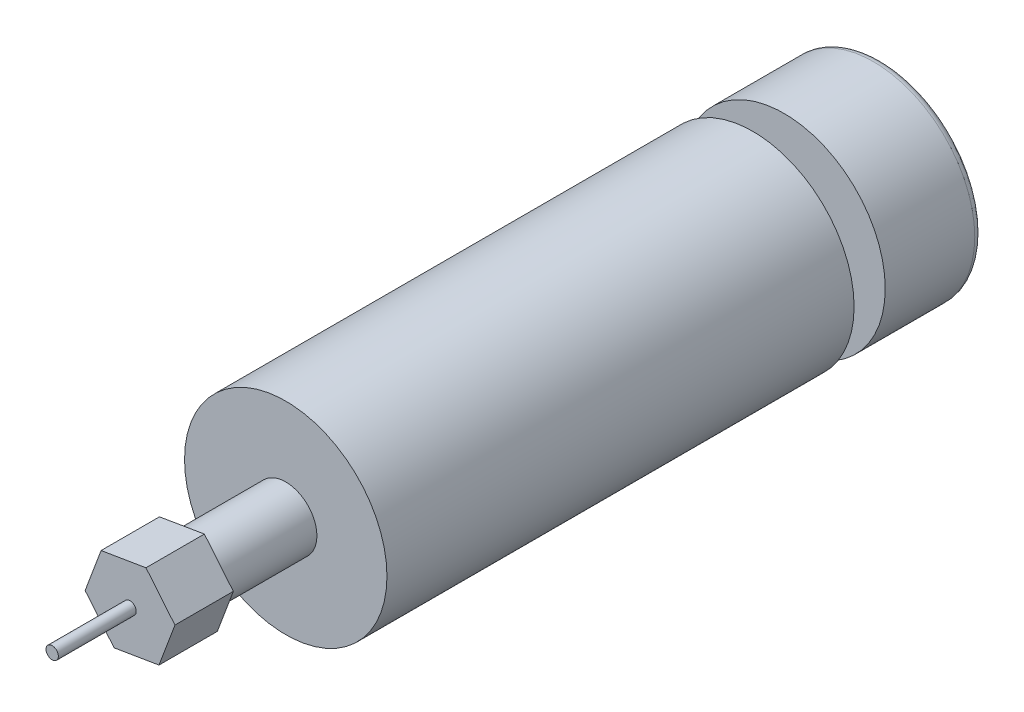
ISO-10303-21;
HEADER;
FILE_DESCRIPTION(('STEP AP214'),'2;1');
FILE_NAME('part.step','',(''),(''),'','','');
FILE_SCHEMA(('AUTOMOTIVE_DESIGN { 1 0 10303 214 1 1 1 1 }'));
ENDSEC;
DATA;
#1=APPLICATION_CONTEXT('core data for automotive mechanical design processes');
#2=APPLICATION_PROTOCOL_DEFINITION('international standard','automotive_design',2000,#1);
#3=PRODUCT_CONTEXT('',#1,'mechanical');
#4=PRODUCT('Part','Part','',(#3));
#5=PRODUCT_RELATED_PRODUCT_CATEGORY('part','',(#4));
#6=PRODUCT_DEFINITION_FORMATION('','',#4);
#7=PRODUCT_DEFINITION_CONTEXT('part definition',#1,'design');
#8=PRODUCT_DEFINITION('design','',#6,#7);
#9=PRODUCT_DEFINITION_SHAPE('','',#8);
#10=(LENGTH_UNIT() NAMED_UNIT(*) SI_UNIT(.MILLI.,.METRE.));
#11=(NAMED_UNIT(*) PLANE_ANGLE_UNIT() SI_UNIT($,.RADIAN.));
#12=(NAMED_UNIT(*) SI_UNIT($,.STERADIAN.) SOLID_ANGLE_UNIT());
#13=UNCERTAINTY_MEASURE_WITH_UNIT(LENGTH_MEASURE(1.E-05),#10,'distance_accuracy_value','');
#14=(GEOMETRIC_REPRESENTATION_CONTEXT(3) GLOBAL_UNCERTAINTY_ASSIGNED_CONTEXT((#13)) GLOBAL_UNIT_ASSIGNED_CONTEXT((#10,
#11,#12)) REPRESENTATION_CONTEXT('',''));
#15=CARTESIAN_POINT('',(0.,0.,0.));
#16=DIRECTION('',(0.,0.,1.));
#17=DIRECTION('',(1.,0.,0.));
#18=AXIS2_PLACEMENT_3D('',#15,#16,#17);
#19=CARTESIAN_POINT('',(0.,0.,-33.));
#20=DIRECTION('',(0.,0.,1.));
#21=DIRECTION('',(1.,0.,0.));
#22=AXIS2_PLACEMENT_3D('',#19,#20,#21);
#23=CYLINDRICAL_SURFACE('',#22,26.);
#24=CARTESIAN_POINT('',(0.,0.,-31.));
#25=DIRECTION('',(0.,0.,-1.));
#26=DIRECTION('',(-1.,0.,0.));
#27=AXIS2_PLACEMENT_3D('',#24,#25,#26);
#28=CIRCLE('',#27,26.);
#29=CARTESIAN_POINT('',(-26.,0.,-31.));
#30=VERTEX_POINT('',#29);
#31=EDGE_CURVE('E11',#30,#30,#28,.F.);
#32=ORIENTED_EDGE('',*,*,#31,.T.);
#33=EDGE_LOOP('',(#32));
#34=FACE_BOUND('',#33,.T.);
#35=CARTESIAN_POINT('',(0.,0.,-8.));
#36=DIRECTION('',(0.,0.,-1.));
#37=DIRECTION('',(-1.,0.,0.));
#38=AXIS2_PLACEMENT_3D('',#35,#36,#37);
#39=CIRCLE('',#38,26.);
#40=CARTESIAN_POINT('',(-26.,0.,-8.));
#41=VERTEX_POINT('',#40);
#42=EDGE_CURVE('E51',#41,#41,#39,.T.);
#43=ORIENTED_EDGE('',*,*,#42,.T.);
#44=EDGE_LOOP('',(#43));
#45=FACE_BOUND('',#44,.T.);
#46=ADVANCED_FACE('F40',(#34,#45),#23,.T.);
#47=CARTESIAN_POINT('',(0.,0.,-33.));
#48=DIRECTION('',(0.,0.,-1.));
#49=DIRECTION('',(-1.,0.,0.));
#50=AXIS2_PLACEMENT_3D('',#47,#48,#49);
#51=PLANE('',#50);
#52=CARTESIAN_POINT('',(0.,0.,-33.));
#53=DIRECTION('',(0.,0.,-1.));
#54=DIRECTION('',(-1.,0.,0.));
#55=AXIS2_PLACEMENT_3D('',#52,#53,#54);
#56=CIRCLE('',#55,24.);
#57=CARTESIAN_POINT('',(-24.,0.,-33.));
#58=VERTEX_POINT('',#57);
#59=EDGE_CURVE('E47',#58,#58,#56,.T.);
#60=ORIENTED_EDGE('',*,*,#59,.T.);
#61=EDGE_LOOP('',(#60));
#62=FACE_BOUND('',#61,.T.);
#63=ADVANCED_FACE('F61',(#62),#51,.T.);
#64=CARTESIAN_POINT('',(0.,0.,-8.));
#65=DIRECTION('',(0.,0.,-1.));
#66=DIRECTION('',(-1.,0.,0.));
#67=AXIS2_PLACEMENT_3D('',#64,#65,#66);
#68=PLANE('',#67);
#69=ORIENTED_EDGE('',*,*,#42,.F.);
#70=EDGE_LOOP('',(#69));
#71=FACE_BOUND('',#70,.T.);
#72=ADVANCED_FACE('F59',(#71),#68,.F.);
#73=CARTESIAN_POINT('',(0.,0.,-31.));
#74=DIRECTION('',(0.,0.,-1.));
#75=DIRECTION('',(-1.,0.,0.));
#76=AXIS2_PLACEMENT_3D('',#73,#74,#75);
#77=TOROIDAL_SURFACE('',#76,24.,2.);
#78=ORIENTED_EDGE('',*,*,#31,.F.);
#79=EDGE_LOOP('',(#78));
#80=FACE_BOUND('',#79,.T.);
#81=ORIENTED_EDGE('',*,*,#59,.F.);
#82=EDGE_LOOP('',(#81));
#83=FACE_BOUND('',#82,.T.);
#84=ADVANCED_FACE('F42',(#80,#83),#77,.T.);
#85=CLOSED_SHELL('',(#46,#63,#72,#84));
#86=MANIFOLD_SOLID_BREP('B2',#85);
#87=CARTESIAN_POINT('',(0.,0.,160.));
#88=DIRECTION('',(0.,0.,-1.));
#89=DIRECTION('',(-1.,0.,0.));
#90=AXIS2_PLACEMENT_3D('',#87,#88,#89);
#91=CYLINDRICAL_SURFACE('',#90,8.);
#92=CARTESIAN_POINT('',(0.,0.,120.));
#93=DIRECTION('',(0.,0.,1.));
#94=DIRECTION('',(1.,0.,0.));
#95=AXIS2_PLACEMENT_3D('',#92,#93,#94);
#96=CIRCLE('',#95,8.);
#97=CARTESIAN_POINT('',(8.,0.,120.));
#98=VERTEX_POINT('',#97);
#99=EDGE_CURVE('E204',#98,#98,#96,.T.);
#100=ORIENTED_EDGE('',*,*,#99,.T.);
#101=EDGE_LOOP('',(#100));
#102=FACE_BOUND('',#101,.T.);
#103=CARTESIAN_POINT('',(0.,0.,145.));
#104=DIRECTION('',(0.,0.,1.));
#105=DIRECTION('',(1.,0.,0.));
#106=AXIS2_PLACEMENT_3D('',#103,#104,#105);
#107=CIRCLE('',#106,8.);
#108=CARTESIAN_POINT('',(8.,0.,145.));
#109=VERTEX_POINT('',#108);
#110=EDGE_CURVE('E216',#109,#109,#107,.T.);
#111=ORIENTED_EDGE('',*,*,#110,.F.);
#112=EDGE_LOOP('',(#111));
#113=FACE_BOUND('',#112,.T.);
#114=ADVANCED_FACE('F96',(#102,#113),#91,.T.);
#115=CARTESIAN_POINT('',(0.,0.,120.));
#116=DIRECTION('',(0.,0.,1.));
#117=DIRECTION('',(1.,0.,0.));
#118=AXIS2_PLACEMENT_3D('',#115,#116,#117);
#119=PLANE('',#118);
#120=CARTESIAN_POINT('',(0.,0.,120.));
#121=DIRECTION('',(0.,0.,1.));
#122=DIRECTION('',(1.,0.,0.));
#123=AXIS2_PLACEMENT_3D('',#120,#121,#122);
#124=CIRCLE('',#123,26.);
#125=CARTESIAN_POINT('',(26.,0.,120.));
#126=VERTEX_POINT('',#125);
#127=EDGE_CURVE('E213',#126,#126,#124,.T.);
#128=ORIENTED_EDGE('',*,*,#127,.T.);
#129=EDGE_LOOP('',(#128));
#130=FACE_BOUND('',#129,.T.);
#131=ORIENTED_EDGE('',*,*,#99,.F.);
#132=EDGE_LOOP('',(#131));
#133=FACE_BOUND('',#132,.T.);
#134=ADVANCED_FACE('F245',(#130,#133),#119,.T.);
#135=CARTESIAN_POINT('',(0.,0.,120.));
#136=DIRECTION('',(0.,0.,-1.));
#137=DIRECTION('',(-1.,0.,0.));
#138=AXIS2_PLACEMENT_3D('',#135,#136,#137);
#139=CYLINDRICAL_SURFACE('',#138,26.);
#140=ORIENTED_EDGE('',*,*,#127,.F.);
#141=EDGE_LOOP('',(#140));
#142=FACE_BOUND('',#141,.T.);
#143=CARTESIAN_POINT('',(0.,0.,0.));
#144=DIRECTION('',(0.,0.,1.));
#145=DIRECTION('',(1.,0.,0.));
#146=AXIS2_PLACEMENT_3D('',#143,#144,#145);
#147=CIRCLE('',#146,26.);
#148=CARTESIAN_POINT('',(26.,0.,0.));
#149=VERTEX_POINT('',#148);
#150=EDGE_CURVE('E212',#149,#149,#147,.T.);
#151=ORIENTED_EDGE('',*,*,#150,.T.);
#152=EDGE_LOOP('',(#151));
#153=FACE_BOUND('',#152,.T.);
#154=ADVANCED_FACE('F98',(#142,#153),#139,.T.);
#155=CARTESIAN_POINT('',(0.,0.,0.));
#156=DIRECTION('',(0.,0.,1.));
#157=DIRECTION('',(1.,0.,0.));
#158=AXIS2_PLACEMENT_3D('',#155,#156,#157);
#159=PLANE('',#158);
#160=CARTESIAN_POINT('',(0.,0.,0.));
#161=DIRECTION('',(0.,0.,-1.));
#162=DIRECTION('',(-1.,0.,0.));
#163=AXIS2_PLACEMENT_3D('',#160,#161,#162);
#164=CIRCLE('',#163,4.);
#165=CARTESIAN_POINT('',(-4.,0.,0.));
#166=VERTEX_POINT('',#165);
#167=EDGE_CURVE('E38',#166,#166,#164,.T.);
#168=ORIENTED_EDGE('',*,*,#167,.F.);
#169=EDGE_LOOP('',(#168));
#170=FACE_BOUND('',#169,.T.);
#171=ORIENTED_EDGE('',*,*,#150,.F.);
#172=EDGE_LOOP('',(#171));
#173=FACE_BOUND('',#172,.T.);
#174=ADVANCED_FACE('F256',(#170,#173),#159,.F.);
#175=CARTESIAN_POINT('',(0.,0.,145.));
#176=DIRECTION('',(0.,0.,1.));
#177=DIRECTION('',(1.,0.,0.));
#178=AXIS2_PLACEMENT_3D('',#175,#176,#177);
#179=PLANE('',#178);
#180=DIRECTION('',(0.350207381259462,0.9366721892484,0.));
#181=VECTOR('',#180,1.);
#182=CARTESIAN_POINT('',(7.43863571553627,-9.02378670105563,145.));
#183=LINE('',#182,#181);
#184=CARTESIAN_POINT('',(7.43863571553627,-9.02378670105563,145.));
#185=VERTEX_POINT('',#184);
#186=CARTESIAN_POINT('',(11.5341463792145,1.93015414862484,145.));
#187=VERTEX_POINT('',#186);
#188=EDGE_CURVE('E202',#185,#187,#183,.T.);
#189=ORIENTED_EDGE('',*,*,#188,.F.);
#190=DIRECTION('',(0.98628560153723,0.165047605860684,0.));
#191=VECTOR('',#190,1.);
#192=CARTESIAN_POINT('',(-4.09551066367821,-10.9539408496805,145.));
#193=LINE('',#192,#191);
#194=CARTESIAN_POINT('',(-4.09551066367821,-10.9539408496805,145.));
#195=VERTEX_POINT('',#194);
#196=EDGE_CURVE('E176',#195,#185,#193,.T.);
#197=ORIENTED_EDGE('',*,*,#196,.F.);
#198=DIRECTION('',(0.636078220277769,-0.771624583387716,0.));
#199=VECTOR('',#198,1.);
#200=CARTESIAN_POINT('',(-11.5341463792145,-1.93015414862484,145.));
#201=LINE('',#200,#199);
#202=CARTESIAN_POINT('',(-11.5341463792145,-1.93015414862484,145.));
#203=VERTEX_POINT('',#202);
#204=EDGE_CURVE('E160',#203,#195,#201,.T.);
#205=ORIENTED_EDGE('',*,*,#204,.F.);
#206=DIRECTION('',(-0.350207381259462,-0.9366721892484,0.));
#207=VECTOR('',#206,1.);
#208=CARTESIAN_POINT('',(-7.43863571553628,9.02378670105563,145.));
#209=LINE('',#208,#207);
#210=CARTESIAN_POINT('',(-7.43863571553628,9.02378670105563,145.));
#211=VERTEX_POINT('',#210);
#212=EDGE_CURVE('E174',#211,#203,#209,.T.);
#213=ORIENTED_EDGE('',*,*,#212,.F.);
#214=DIRECTION('',(-0.98628560153723,-0.165047605860684,0.));
#215=VECTOR('',#214,1.);
#216=CARTESIAN_POINT('',(4.09551066367821,10.9539408496805,145.));
#217=LINE('',#216,#215);
#218=CARTESIAN_POINT('',(4.09551066367821,10.9539408496805,145.));
#219=VERTEX_POINT('',#218);
#220=EDGE_CURVE('E179',#219,#211,#217,.T.);
#221=ORIENTED_EDGE('',*,*,#220,.F.);
#222=DIRECTION('',(-0.636078220277769,0.771624583387716,0.));
#223=VECTOR('',#222,1.);
#224=CARTESIAN_POINT('',(11.5341463792145,1.93015414862484,145.));
#225=LINE('',#224,#223);
#226=EDGE_CURVE('E181',#187,#219,#225,.T.);
#227=ORIENTED_EDGE('',*,*,#226,.F.);
#228=EDGE_LOOP('',(#189,#197,#205,#213,#221,#227));
#229=FACE_BOUND('',#228,.T.);
#230=ORIENTED_EDGE('',*,*,#110,.T.);
#231=EDGE_LOOP('',(#230));
#232=FACE_BOUND('',#231,.T.);
#233=ADVANCED_FACE('F171',(#229,#232),#179,.F.);
#234=CARTESIAN_POINT('',(7.43863571553627,-9.02378670105563,145.));
#235=DIRECTION('',(0.9366721892484,-0.350207381259462,0.));
#236=DIRECTION('',(0.350207381259462,0.9366721892484,0.));
#237=AXIS2_PLACEMENT_3D('',#234,#235,#236);
#238=PLANE('',#237);
#239=DIRECTION('',(0.350207381259462,0.9366721892484,0.));
#240=VECTOR('',#239,1.);
#241=CARTESIAN_POINT('',(7.43863571553627,-9.02378670105563,160.));
#242=LINE('',#241,#240);
#243=CARTESIAN_POINT('',(7.43863571553627,-9.02378670105563,160.));
#244=VERTEX_POINT('',#243);
#245=CARTESIAN_POINT('',(11.5341463792145,1.93015414862484,160.));
#246=VERTEX_POINT('',#245);
#247=EDGE_CURVE('E186',#244,#246,#242,.T.);
#248=ORIENTED_EDGE('',*,*,#247,.F.);
#249=DIRECTION('',(0.,0.,1.));
#250=VECTOR('',#249,1.);
#251=CARTESIAN_POINT('',(7.43863571553627,-9.02378670105563,145.));
#252=LINE('',#251,#250);
#253=EDGE_CURVE('E114',#185,#244,#252,.T.);
#254=ORIENTED_EDGE('',*,*,#253,.F.);
#255=ORIENTED_EDGE('',*,*,#188,.T.);
#256=DIRECTION('',(0.,0.,1.));
#257=VECTOR('',#256,1.);
#258=CARTESIAN_POINT('',(11.5341463792145,1.93015414862484,145.));
#259=LINE('',#258,#257);
#260=EDGE_CURVE('E149',#187,#246,#259,.T.);
#261=ORIENTED_EDGE('',*,*,#260,.T.);
#262=EDGE_LOOP('',(#248,#254,#255,#261));
#263=FACE_BOUND('',#262,.T.);
#264=ADVANCED_FACE('F230',(#263),#238,.T.);
#265=CARTESIAN_POINT('',(-4.09551066367821,-10.9539408496805,145.));
#266=DIRECTION('',(0.165047605860684,-0.98628560153723,0.));
#267=DIRECTION('',(0.98628560153723,0.165047605860684,0.));
#268=AXIS2_PLACEMENT_3D('',#265,#266,#267);
#269=PLANE('',#268);
#270=DIRECTION('',(0.98628560153723,0.165047605860684,0.));
#271=VECTOR('',#270,1.);
#272=CARTESIAN_POINT('',(-4.09551066367821,-10.9539408496805,160.));
#273=LINE('',#272,#271);
#274=CARTESIAN_POINT('',(-4.09551066367821,-10.9539408496805,160.));
#275=VERTEX_POINT('',#274);
#276=EDGE_CURVE('E199',#275,#244,#273,.T.);
#277=ORIENTED_EDGE('',*,*,#276,.F.);
#278=DIRECTION('',(0.,0.,1.));
#279=VECTOR('',#278,1.);
#280=CARTESIAN_POINT('',(-4.09551066367821,-10.9539408496805,145.));
#281=LINE('',#280,#279);
#282=EDGE_CURVE('E137',#195,#275,#281,.T.);
#283=ORIENTED_EDGE('',*,*,#282,.F.);
#284=ORIENTED_EDGE('',*,*,#196,.T.);
#285=ORIENTED_EDGE('',*,*,#253,.T.);
#286=EDGE_LOOP('',(#277,#283,#284,#285));
#287=FACE_BOUND('',#286,.T.);
#288=ADVANCED_FACE('F234',(#287),#269,.T.);
#289=CARTESIAN_POINT('',(-11.5341463792145,-1.93015414862484,145.));
#290=DIRECTION('',(-0.771624583387716,-0.636078220277769,0.));
#291=DIRECTION('',(0.636078220277769,-0.771624583387716,0.));
#292=AXIS2_PLACEMENT_3D('',#289,#290,#291);
#293=PLANE('',#292);
#294=DIRECTION('',(0.636078220277769,-0.771624583387716,0.));
#295=VECTOR('',#294,1.);
#296=CARTESIAN_POINT('',(-11.5341463792145,-1.93015414862484,160.));
#297=LINE('',#296,#295);
#298=CARTESIAN_POINT('',(-11.5341463792145,-1.93015414862484,160.));
#299=VERTEX_POINT('',#298);
#300=EDGE_CURVE('E162',#299,#275,#297,.T.);
#301=ORIENTED_EDGE('',*,*,#300,.F.);
#302=DIRECTION('',(0.,0.,1.));
#303=VECTOR('',#302,1.);
#304=CARTESIAN_POINT('',(-11.5341463792145,-1.93015414862484,145.));
#305=LINE('',#304,#303);
#306=EDGE_CURVE('E157',#203,#299,#305,.T.);
#307=ORIENTED_EDGE('',*,*,#306,.F.);
#308=ORIENTED_EDGE('',*,*,#204,.T.);
#309=ORIENTED_EDGE('',*,*,#282,.T.);
#310=EDGE_LOOP('',(#301,#307,#308,#309));
#311=FACE_BOUND('',#310,.T.);
#312=ADVANCED_FACE('F159',(#311),#293,.T.);
#313=CARTESIAN_POINT('',(-7.43863571553628,9.02378670105563,145.));
#314=DIRECTION('',(-0.9366721892484,0.350207381259462,0.));
#315=DIRECTION('',(-0.350207381259462,-0.9366721892484,0.));
#316=AXIS2_PLACEMENT_3D('',#313,#314,#315);
#317=PLANE('',#316);
#318=DIRECTION('',(-0.350207381259462,-0.9366721892484,0.));
#319=VECTOR('',#318,1.);
#320=CARTESIAN_POINT('',(-7.43863571553628,9.02378670105563,160.));
#321=LINE('',#320,#319);
#322=CARTESIAN_POINT('',(-7.43863571553628,9.02378670105563,160.));
#323=VERTEX_POINT('',#322);
#324=EDGE_CURVE('E196',#323,#299,#321,.T.);
#325=ORIENTED_EDGE('',*,*,#324,.F.);
#326=DIRECTION('',(0.,0.,1.));
#327=VECTOR('',#326,1.);
#328=CARTESIAN_POINT('',(-7.43863571553628,9.02378670105563,145.));
#329=LINE('',#328,#327);
#330=EDGE_CURVE('E167',#211,#323,#329,.T.);
#331=ORIENTED_EDGE('',*,*,#330,.F.);
#332=ORIENTED_EDGE('',*,*,#212,.T.);
#333=ORIENTED_EDGE('',*,*,#306,.T.);
#334=EDGE_LOOP('',(#325,#331,#332,#333));
#335=FACE_BOUND('',#334,.T.);
#336=ADVANCED_FACE('F178',(#335),#317,.T.);
#337=CARTESIAN_POINT('',(4.09551066367821,10.9539408496805,145.));
#338=DIRECTION('',(-0.165047605860684,0.98628560153723,0.));
#339=DIRECTION('',(-0.98628560153723,-0.165047605860684,0.));
#340=AXIS2_PLACEMENT_3D('',#337,#338,#339);
#341=PLANE('',#340);
#342=DIRECTION('',(-0.98628560153723,-0.165047605860684,0.));
#343=VECTOR('',#342,1.);
#344=CARTESIAN_POINT('',(4.09551066367821,10.9539408496805,160.));
#345=LINE('',#344,#343);
#346=CARTESIAN_POINT('',(4.09551066367821,10.9539408496805,160.));
#347=VERTEX_POINT('',#346);
#348=EDGE_CURVE('E193',#347,#323,#345,.T.);
#349=ORIENTED_EDGE('',*,*,#348,.F.);
#350=DIRECTION('',(0.,0.,1.));
#351=VECTOR('',#350,1.);
#352=CARTESIAN_POINT('',(4.09551066367821,10.9539408496805,145.));
#353=LINE('',#352,#351);
#354=EDGE_CURVE('E207',#219,#347,#353,.T.);
#355=ORIENTED_EDGE('',*,*,#354,.F.);
#356=ORIENTED_EDGE('',*,*,#220,.T.);
#357=ORIENTED_EDGE('',*,*,#330,.T.);
#358=EDGE_LOOP('',(#349,#355,#356,#357));
#359=FACE_BOUND('',#358,.T.);
#360=ADVANCED_FACE('F233',(#359),#341,.T.);
#361=CARTESIAN_POINT('',(11.5341463792145,1.93015414862484,145.));
#362=DIRECTION('',(0.771624583387716,0.636078220277769,0.));
#363=DIRECTION('',(-0.636078220277769,0.771624583387716,0.));
#364=AXIS2_PLACEMENT_3D('',#361,#362,#363);
#365=PLANE('',#364);
#366=DIRECTION('',(-0.636078220277769,0.771624583387716,0.));
#367=VECTOR('',#366,1.);
#368=CARTESIAN_POINT('',(11.5341463792145,1.93015414862484,160.));
#369=LINE('',#368,#367);
#370=EDGE_CURVE('E189',#246,#347,#369,.T.);
#371=ORIENTED_EDGE('',*,*,#370,.F.);
#372=ORIENTED_EDGE('',*,*,#260,.F.);
#373=ORIENTED_EDGE('',*,*,#226,.T.);
#374=ORIENTED_EDGE('',*,*,#354,.T.);
#375=EDGE_LOOP('',(#371,#372,#373,#374));
#376=FACE_BOUND('',#375,.T.);
#377=ADVANCED_FACE('F228',(#376),#365,.T.);
#378=CARTESIAN_POINT('',(0.,0.,160.));
#379=DIRECTION('',(0.,0.,1.));
#380=DIRECTION('',(1.,0.,0.));
#381=AXIS2_PLACEMENT_3D('',#378,#379,#380);
#382=PLANE('',#381);
#383=CARTESIAN_POINT('',(0.,0.,160.));
#384=DIRECTION('',(0.,0.,1.));
#385=DIRECTION('',(1.,0.,0.));
#386=AXIS2_PLACEMENT_3D('',#383,#384,#385);
#387=CIRCLE('',#386,1.5875);
#388=CARTESIAN_POINT('',(1.5875,0.,160.));
#389=VERTEX_POINT('',#388);
#390=EDGE_CURVE('E100',#389,#389,#387,.T.);
#391=ORIENTED_EDGE('',*,*,#390,.F.);
#392=EDGE_LOOP('',(#391));
#393=FACE_BOUND('',#392,.T.);
#394=ORIENTED_EDGE('',*,*,#247,.T.);
#395=ORIENTED_EDGE('',*,*,#370,.T.);
#396=ORIENTED_EDGE('',*,*,#348,.T.);
#397=ORIENTED_EDGE('',*,*,#324,.T.);
#398=ORIENTED_EDGE('',*,*,#300,.T.);
#399=ORIENTED_EDGE('',*,*,#276,.T.);
#400=EDGE_LOOP('',(#394,#395,#396,#397,#398,#399));
#401=FACE_BOUND('',#400,.T.);
#402=ADVANCED_FACE('F225',(#393,#401),#382,.T.);
#403=CARTESIAN_POINT('',(0.,0.,180.));
#404=DIRECTION('',(0.,0.,-1.));
#405=DIRECTION('',(-1.,0.,0.));
#406=AXIS2_PLACEMENT_3D('',#403,#404,#405);
#407=CYLINDRICAL_SURFACE('',#406,1.5875);
#408=CARTESIAN_POINT('',(0.,0.,180.));
#409=DIRECTION('',(0.,0.,-1.));
#410=DIRECTION('',(-1.,0.,0.));
#411=AXIS2_PLACEMENT_3D('',#408,#409,#410);
#412=CIRCLE('',#411,1.5875);
#413=CARTESIAN_POINT('',(-1.5875,0.,180.));
#414=VERTEX_POINT('',#413);
#415=EDGE_CURVE('E190',#414,#414,#412,.T.);
#416=ORIENTED_EDGE('',*,*,#415,.T.);
#417=EDGE_LOOP('',(#416));
#418=FACE_BOUND('',#417,.T.);
#419=ORIENTED_EDGE('',*,*,#390,.T.);
#420=EDGE_LOOP('',(#419));
#421=FACE_BOUND('',#420,.T.);
#422=ADVANCED_FACE('F223',(#418,#421),#407,.T.);
#423=CARTESIAN_POINT('',(0.,0.,180.));
#424=DIRECTION('',(0.,0.,-1.));
#425=DIRECTION('',(-1.,0.,0.));
#426=AXIS2_PLACEMENT_3D('',#423,#424,#425);
#427=PLANE('',#426);
#428=ORIENTED_EDGE('',*,*,#415,.F.);
#429=EDGE_LOOP('',(#428));
#430=FACE_BOUND('',#429,.T.);
#431=ADVANCED_FACE('F273',(#430),#427,.F.);
#432=CARTESIAN_POINT('',(0.,0.,-6.));
#433=DIRECTION('',(0.,0.,1.));
#434=DIRECTION('',(1.,0.,0.));
#435=AXIS2_PLACEMENT_3D('',#432,#433,#434);
#436=CYLINDRICAL_SURFACE('',#435,4.);
#437=CARTESIAN_POINT('',(0.,0.,-6.));
#438=DIRECTION('',(0.,0.,-1.));
#439=DIRECTION('',(-1.,0.,0.));
#440=AXIS2_PLACEMENT_3D('',#437,#438,#439);
#441=CIRCLE('',#440,4.);
#442=CARTESIAN_POINT('',(-4.,0.,-6.));
#443=VERTEX_POINT('',#442);
#444=EDGE_CURVE('E291',#443,#443,#441,.T.);
#445=ORIENTED_EDGE('',*,*,#444,.F.);
#446=EDGE_LOOP('',(#445));
#447=FACE_BOUND('',#446,.T.);
#448=ORIENTED_EDGE('',*,*,#167,.T.);
#449=EDGE_LOOP('',(#448));
#450=FACE_BOUND('',#449,.T.);
#451=ADVANCED_FACE('F270',(#447,#450),#436,.T.);
#452=CARTESIAN_POINT('',(0.,0.,-6.));
#453=DIRECTION('',(0.,0.,-1.));
#454=DIRECTION('',(-1.,0.,0.));
#455=AXIS2_PLACEMENT_3D('',#452,#453,#454);
#456=PLANE('',#455);
#457=ORIENTED_EDGE('',*,*,#444,.T.);
#458=EDGE_LOOP('',(#457));
#459=FACE_BOUND('',#458,.T.);
#460=ADVANCED_FACE('F272',(#459),#456,.T.);
#461=CLOSED_SHELL('',(#114,#134,#154,#174,#233,#264,#288,#312,#336,#360,#377,#402,#422,#431,
#451,#460));
#462=MANIFOLD_SOLID_BREP('B6',#461);
#463=ADVANCED_BREP_SHAPE_REPRESENTATION('',(#18,#86,#462),#14);
#464=SHAPE_DEFINITION_REPRESENTATION(#9,#463);
ENDSEC;
END-ISO-10303-21;
